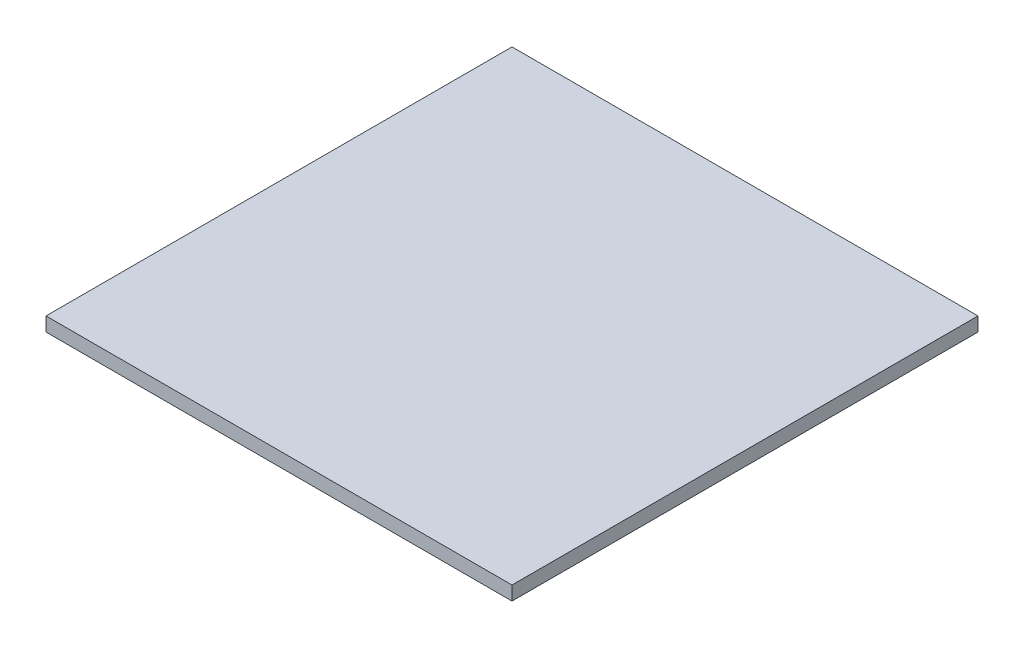
ISO-10303-21;
HEADER;
FILE_DESCRIPTION(('STEP AP214'),'2;1');
FILE_NAME('part.step','',(''),(''),'','','');
FILE_SCHEMA(('AUTOMOTIVE_DESIGN { 1 0 10303 214 1 1 1 1 }'));
ENDSEC;
DATA;
#1=APPLICATION_CONTEXT('core data for automotive mechanical design processes');
#2=APPLICATION_PROTOCOL_DEFINITION('international standard','automotive_design',2000,#1);
#3=PRODUCT_CONTEXT('',#1,'mechanical');
#4=PRODUCT('Part','Part','',(#3));
#5=PRODUCT_RELATED_PRODUCT_CATEGORY('part','',(#4));
#6=PRODUCT_DEFINITION_FORMATION('','',#4);
#7=PRODUCT_DEFINITION_CONTEXT('part definition',#1,'design');
#8=PRODUCT_DEFINITION('design','',#6,#7);
#9=PRODUCT_DEFINITION_SHAPE('','',#8);
#10=(LENGTH_UNIT() NAMED_UNIT(*) SI_UNIT(.MILLI.,.METRE.));
#11=(NAMED_UNIT(*) PLANE_ANGLE_UNIT() SI_UNIT($,.RADIAN.));
#12=(NAMED_UNIT(*) SI_UNIT($,.STERADIAN.) SOLID_ANGLE_UNIT());
#13=UNCERTAINTY_MEASURE_WITH_UNIT(LENGTH_MEASURE(1.E-05),#10,'distance_accuracy_value','');
#14=(GEOMETRIC_REPRESENTATION_CONTEXT(3) GLOBAL_UNCERTAINTY_ASSIGNED_CONTEXT((#13)) GLOBAL_UNIT_ASSIGNED_CONTEXT((#10,
#11,#12)) REPRESENTATION_CONTEXT('',''));
#15=CARTESIAN_POINT('',(0.,0.,0.));
#16=DIRECTION('',(0.,0.,1.));
#17=DIRECTION('',(1.,0.,0.));
#18=AXIS2_PLACEMENT_3D('',#15,#16,#17);
#19=CARTESIAN_POINT('',(50.,3.,-50.));
#20=DIRECTION('',(-1.,0.,0.));
#21=DIRECTION('',(0.,0.,1.));
#22=AXIS2_PLACEMENT_3D('',#19,#20,#21);
#23=PLANE('',#22);
#24=DIRECTION('',(0.,0.,-1.));
#25=VECTOR('',#24,1.);
#26=CARTESIAN_POINT('',(50.,0.,-50.));
#27=LINE('',#26,#25);
#28=CARTESIAN_POINT('',(50.,0.,50.));
#29=VERTEX_POINT('',#28);
#30=CARTESIAN_POINT('',(50.,0.,-50.));
#31=VERTEX_POINT('',#30);
#32=EDGE_CURVE('E98',#29,#31,#27,.T.);
#33=ORIENTED_EDGE('',*,*,#32,.T.);
#34=DIRECTION('',(0.,-1.,0.));
#35=VECTOR('',#34,1.);
#36=CARTESIAN_POINT('',(50.,3.,-50.));
#37=LINE('',#36,#35);
#38=CARTESIAN_POINT('',(50.,3.,-50.));
#39=VERTEX_POINT('',#38);
#40=EDGE_CURVE('E11',#39,#31,#37,.T.);
#41=ORIENTED_EDGE('',*,*,#40,.F.);
#42=DIRECTION('',(0.,0.,-1.));
#43=VECTOR('',#42,1.);
#44=CARTESIAN_POINT('',(50.,3.,-50.));
#45=LINE('',#44,#43);
#46=CARTESIAN_POINT('',(50.,3.,50.));
#47=VERTEX_POINT('',#46);
#48=EDGE_CURVE('E86',#47,#39,#45,.T.);
#49=ORIENTED_EDGE('',*,*,#48,.F.);
#50=DIRECTION('',(0.,-1.,0.));
#51=VECTOR('',#50,1.);
#52=CARTESIAN_POINT('',(50.,3.,50.));
#53=LINE('',#52,#51);
#54=EDGE_CURVE('E94',#47,#29,#53,.T.);
#55=ORIENTED_EDGE('',*,*,#54,.T.);
#56=EDGE_LOOP('',(#33,#41,#49,#55));
#57=FACE_BOUND('',#56,.T.);
#58=ADVANCED_FACE('F35',(#57),#23,.F.);
#59=CARTESIAN_POINT('',(-50.,3.,-50.));
#60=DIRECTION('',(0.,0.,1.));
#61=DIRECTION('',(1.,0.,0.));
#62=AXIS2_PLACEMENT_3D('',#59,#60,#61);
#63=PLANE('',#62);
#64=DIRECTION('',(-1.,0.,0.));
#65=VECTOR('',#64,1.);
#66=CARTESIAN_POINT('',(-50.,0.,-50.));
#67=LINE('',#66,#65);
#68=CARTESIAN_POINT('',(-50.,0.,-50.));
#69=VERTEX_POINT('',#68);
#70=EDGE_CURVE('E90',#31,#69,#67,.T.);
#71=ORIENTED_EDGE('',*,*,#70,.T.);
#72=DIRECTION('',(0.,-1.,0.));
#73=VECTOR('',#72,1.);
#74=CARTESIAN_POINT('',(-50.,3.,-50.));
#75=LINE('',#74,#73);
#76=CARTESIAN_POINT('',(-50.,3.,-50.));
#77=VERTEX_POINT('',#76);
#78=EDGE_CURVE('E43',#77,#69,#75,.T.);
#79=ORIENTED_EDGE('',*,*,#78,.F.);
#80=DIRECTION('',(-1.,0.,0.));
#81=VECTOR('',#80,1.);
#82=CARTESIAN_POINT('',(-50.,3.,-50.));
#83=LINE('',#82,#81);
#84=EDGE_CURVE('E81',#39,#77,#83,.T.);
#85=ORIENTED_EDGE('',*,*,#84,.F.);
#86=ORIENTED_EDGE('',*,*,#40,.T.);
#87=EDGE_LOOP('',(#71,#79,#85,#86));
#88=FACE_BOUND('',#87,.T.);
#89=ADVANCED_FACE('F89',(#88),#63,.F.);
#90=CARTESIAN_POINT('',(-50.,3.,-50.));
#91=DIRECTION('',(1.,0.,0.));
#92=DIRECTION('',(0.,0.,-1.));
#93=AXIS2_PLACEMENT_3D('',#90,#91,#92);
#94=PLANE('',#93);
#95=DIRECTION('',(0.,0.,1.));
#96=VECTOR('',#95,1.);
#97=CARTESIAN_POINT('',(-50.,0.,-50.));
#98=LINE('',#97,#96);
#99=CARTESIAN_POINT('',(-50.,0.,50.));
#100=VERTEX_POINT('',#99);
#101=EDGE_CURVE('E68',#69,#100,#98,.T.);
#102=ORIENTED_EDGE('',*,*,#101,.T.);
#103=DIRECTION('',(0.,-1.,0.));
#104=VECTOR('',#103,1.);
#105=CARTESIAN_POINT('',(-50.,3.,50.));
#106=LINE('',#105,#104);
#107=CARTESIAN_POINT('',(-50.,3.,50.));
#108=VERTEX_POINT('',#107);
#109=EDGE_CURVE('E91',#108,#100,#106,.T.);
#110=ORIENTED_EDGE('',*,*,#109,.F.);
#111=DIRECTION('',(0.,0.,1.));
#112=VECTOR('',#111,1.);
#113=CARTESIAN_POINT('',(-50.,3.,-50.));
#114=LINE('',#113,#112);
#115=EDGE_CURVE('E84',#77,#108,#114,.T.);
#116=ORIENTED_EDGE('',*,*,#115,.F.);
#117=ORIENTED_EDGE('',*,*,#78,.T.);
#118=EDGE_LOOP('',(#102,#110,#116,#117));
#119=FACE_BOUND('',#118,.T.);
#120=ADVANCED_FACE('F92',(#119),#94,.F.);
#121=CARTESIAN_POINT('',(-50.,3.,50.));
#122=DIRECTION('',(0.,0.,-1.));
#123=DIRECTION('',(-1.,0.,0.));
#124=AXIS2_PLACEMENT_3D('',#121,#122,#123);
#125=PLANE('',#124);
#126=DIRECTION('',(1.,0.,0.));
#127=VECTOR('',#126,1.);
#128=CARTESIAN_POINT('',(-50.,0.,50.));
#129=LINE('',#128,#127);
#130=EDGE_CURVE('E74',#100,#29,#129,.T.);
#131=ORIENTED_EDGE('',*,*,#130,.T.);
#132=ORIENTED_EDGE('',*,*,#54,.F.);
#133=DIRECTION('',(1.,0.,0.));
#134=VECTOR('',#133,1.);
#135=CARTESIAN_POINT('',(-50.,3.,50.));
#136=LINE('',#135,#134);
#137=EDGE_CURVE('E51',#108,#47,#136,.T.);
#138=ORIENTED_EDGE('',*,*,#137,.F.);
#139=ORIENTED_EDGE('',*,*,#109,.T.);
#140=EDGE_LOOP('',(#131,#132,#138,#139));
#141=FACE_BOUND('',#140,.T.);
#142=ADVANCED_FACE('F105',(#141),#125,.F.);
#143=CARTESIAN_POINT('',(0.,3.,0.));
#144=DIRECTION('',(0.,1.,0.));
#145=DIRECTION('',(0.,0.,1.));
#146=AXIS2_PLACEMENT_3D('',#143,#144,#145);
#147=PLANE('',#146);
#148=ORIENTED_EDGE('',*,*,#48,.T.);
#149=ORIENTED_EDGE('',*,*,#84,.T.);
#150=ORIENTED_EDGE('',*,*,#115,.T.);
#151=ORIENTED_EDGE('',*,*,#137,.T.);
#152=EDGE_LOOP('',(#148,#149,#150,#151));
#153=FACE_BOUND('',#152,.T.);
#154=ADVANCED_FACE('F82',(#153),#147,.T.);
#155=CARTESIAN_POINT('',(0.,0.,0.));
#156=DIRECTION('',(0.,1.,0.));
#157=DIRECTION('',(0.,0.,1.));
#158=AXIS2_PLACEMENT_3D('',#155,#156,#157);
#159=PLANE('',#158);
#160=ORIENTED_EDGE('',*,*,#32,.F.);
#161=ORIENTED_EDGE('',*,*,#130,.F.);
#162=ORIENTED_EDGE('',*,*,#101,.F.);
#163=ORIENTED_EDGE('',*,*,#70,.F.);
#164=EDGE_LOOP('',(#160,#161,#162,#163));
#165=FACE_BOUND('',#164,.T.);
#166=ADVANCED_FACE('F108',(#165),#159,.F.);
#167=CLOSED_SHELL('',(#58,#89,#120,#142,#154,#166));
#168=MANIFOLD_SOLID_BREP('B2',#167);
#169=ADVANCED_BREP_SHAPE_REPRESENTATION('',(#18,#168),#14);
#170=SHAPE_DEFINITION_REPRESENTATION(#9,#169);
ENDSEC;
END-ISO-10303-21;
